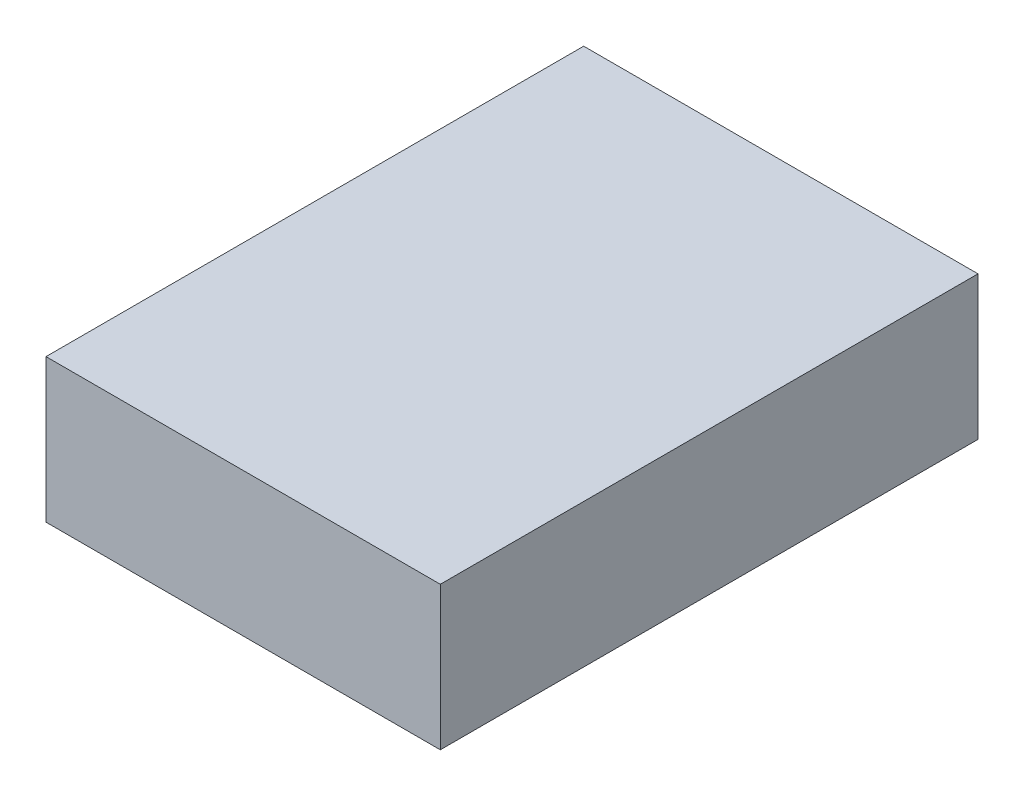
ISO-10303-21;
HEADER;
FILE_DESCRIPTION(('STEP AP214'),'2;1');
FILE_NAME('part.step','',(''),(''),'','','');
FILE_SCHEMA(('AUTOMOTIVE_DESIGN { 1 0 10303 214 1 1 1 1 }'));
ENDSEC;
DATA;
#1=APPLICATION_CONTEXT('core data for automotive mechanical design processes');
#2=APPLICATION_PROTOCOL_DEFINITION('international standard','automotive_design',2000,#1);
#3=PRODUCT_CONTEXT('',#1,'mechanical');
#4=PRODUCT('Part','Part','',(#3));
#5=PRODUCT_RELATED_PRODUCT_CATEGORY('part','',(#4));
#6=PRODUCT_DEFINITION_FORMATION('','',#4);
#7=PRODUCT_DEFINITION_CONTEXT('part definition',#1,'design');
#8=PRODUCT_DEFINITION('design','',#6,#7);
#9=PRODUCT_DEFINITION_SHAPE('','',#8);
#10=(LENGTH_UNIT() NAMED_UNIT(*) SI_UNIT(.MILLI.,.METRE.));
#11=(NAMED_UNIT(*) PLANE_ANGLE_UNIT() SI_UNIT($,.RADIAN.));
#12=(NAMED_UNIT(*) SI_UNIT($,.STERADIAN.) SOLID_ANGLE_UNIT());
#13=UNCERTAINTY_MEASURE_WITH_UNIT(LENGTH_MEASURE(1.E-05),#10,'distance_accuracy_value','');
#14=(GEOMETRIC_REPRESENTATION_CONTEXT(3) GLOBAL_UNCERTAINTY_ASSIGNED_CONTEXT((#13)) GLOBAL_UNIT_ASSIGNED_CONTEXT((#10,
#11,#12)) REPRESENTATION_CONTEXT('',''));
#15=CARTESIAN_POINT('',(0.,0.,0.));
#16=DIRECTION('',(0.,0.,1.));
#17=DIRECTION('',(1.,0.,0.));
#18=AXIS2_PLACEMENT_3D('',#15,#16,#17);
#19=CARTESIAN_POINT('',(0.,25.4,0.));
#20=DIRECTION('',(1.,0.,0.));
#21=DIRECTION('',(0.,0.,-1.));
#22=AXIS2_PLACEMENT_3D('',#19,#20,#21);
#23=PLANE('',#22);
#24=DIRECTION('',(0.,0.,1.));
#25=VECTOR('',#24,1.);
#26=CARTESIAN_POINT('',(0.,0.,0.));
#27=LINE('',#26,#25);
#28=CARTESIAN_POINT('',(0.,0.,-95.25));
#29=VERTEX_POINT('',#28);
#30=CARTESIAN_POINT('',(0.,0.,0.));
#31=VERTEX_POINT('',#30);
#32=EDGE_CURVE('E97',#29,#31,#27,.T.);
#33=ORIENTED_EDGE('',*,*,#32,.T.);
#34=DIRECTION('',(0.,-1.,0.));
#35=VECTOR('',#34,1.);
#36=CARTESIAN_POINT('',(0.,25.4,0.));
#37=LINE('',#36,#35);
#38=CARTESIAN_POINT('',(0.,25.4,0.));
#39=VERTEX_POINT('',#38);
#40=EDGE_CURVE('E11',#39,#31,#37,.T.);
#41=ORIENTED_EDGE('',*,*,#40,.F.);
#42=DIRECTION('',(0.,0.,1.));
#43=VECTOR('',#42,1.);
#44=CARTESIAN_POINT('',(0.,25.4,0.));
#45=LINE('',#44,#43);
#46=CARTESIAN_POINT('',(0.,25.4,-95.25));
#47=VERTEX_POINT('',#46);
#48=EDGE_CURVE('E85',#47,#39,#45,.T.);
#49=ORIENTED_EDGE('',*,*,#48,.F.);
#50=DIRECTION('',(0.,-1.,0.));
#51=VECTOR('',#50,1.);
#52=CARTESIAN_POINT('',(0.,25.4,-95.25));
#53=LINE('',#52,#51);
#54=EDGE_CURVE('E93',#47,#29,#53,.T.);
#55=ORIENTED_EDGE('',*,*,#54,.T.);
#56=EDGE_LOOP('',(#33,#41,#49,#55));
#57=FACE_BOUND('',#56,.T.);
#58=ADVANCED_FACE('F34',(#57),#23,.F.);
#59=CARTESIAN_POINT('',(0.,25.4,0.));
#60=DIRECTION('',(0.,0.,-1.));
#61=DIRECTION('',(-1.,0.,0.));
#62=AXIS2_PLACEMENT_3D('',#59,#60,#61);
#63=PLANE('',#62);
#64=DIRECTION('',(1.,0.,0.));
#65=VECTOR('',#64,1.);
#66=CARTESIAN_POINT('',(0.,0.,0.));
#67=LINE('',#66,#65);
#68=CARTESIAN_POINT('',(69.85,0.,0.));
#69=VERTEX_POINT('',#68);
#70=EDGE_CURVE('E89',#31,#69,#67,.T.);
#71=ORIENTED_EDGE('',*,*,#70,.T.);
#72=DIRECTION('',(0.,-1.,0.));
#73=VECTOR('',#72,1.);
#74=CARTESIAN_POINT('',(69.85,25.4,0.));
#75=LINE('',#74,#73);
#76=CARTESIAN_POINT('',(69.85,25.4,0.));
#77=VERTEX_POINT('',#76);
#78=EDGE_CURVE('E42',#77,#69,#75,.T.);
#79=ORIENTED_EDGE('',*,*,#78,.F.);
#80=DIRECTION('',(1.,0.,0.));
#81=VECTOR('',#80,1.);
#82=CARTESIAN_POINT('',(0.,25.4,0.));
#83=LINE('',#82,#81);
#84=EDGE_CURVE('E80',#39,#77,#83,.T.);
#85=ORIENTED_EDGE('',*,*,#84,.F.);
#86=ORIENTED_EDGE('',*,*,#40,.T.);
#87=EDGE_LOOP('',(#71,#79,#85,#86));
#88=FACE_BOUND('',#87,.T.);
#89=ADVANCED_FACE('F88',(#88),#63,.F.);
#90=CARTESIAN_POINT('',(69.85,25.4,0.));
#91=DIRECTION('',(-1.,0.,0.));
#92=DIRECTION('',(0.,0.,1.));
#93=AXIS2_PLACEMENT_3D('',#90,#91,#92);
#94=PLANE('',#93);
#95=DIRECTION('',(0.,0.,-1.));
#96=VECTOR('',#95,1.);
#97=CARTESIAN_POINT('',(69.85,0.,0.));
#98=LINE('',#97,#96);
#99=CARTESIAN_POINT('',(69.85,0.,-95.25));
#100=VERTEX_POINT('',#99);
#101=EDGE_CURVE('E67',#69,#100,#98,.T.);
#102=ORIENTED_EDGE('',*,*,#101,.T.);
#103=DIRECTION('',(0.,-1.,0.));
#104=VECTOR('',#103,1.);
#105=CARTESIAN_POINT('',(69.85,25.4,-95.25));
#106=LINE('',#105,#104);
#107=CARTESIAN_POINT('',(69.85,25.4,-95.25));
#108=VERTEX_POINT('',#107);
#109=EDGE_CURVE('E90',#108,#100,#106,.T.);
#110=ORIENTED_EDGE('',*,*,#109,.F.);
#111=DIRECTION('',(0.,0.,-1.));
#112=VECTOR('',#111,1.);
#113=CARTESIAN_POINT('',(69.85,25.4,0.));
#114=LINE('',#113,#112);
#115=EDGE_CURVE('E83',#77,#108,#114,.T.);
#116=ORIENTED_EDGE('',*,*,#115,.F.);
#117=ORIENTED_EDGE('',*,*,#78,.T.);
#118=EDGE_LOOP('',(#102,#110,#116,#117));
#119=FACE_BOUND('',#118,.T.);
#120=ADVANCED_FACE('F91',(#119),#94,.F.);
#121=CARTESIAN_POINT('',(0.,25.4,-95.25));
#122=DIRECTION('',(0.,0.,1.));
#123=DIRECTION('',(1.,0.,0.));
#124=AXIS2_PLACEMENT_3D('',#121,#122,#123);
#125=PLANE('',#124);
#126=DIRECTION('',(-1.,0.,0.));
#127=VECTOR('',#126,1.);
#128=CARTESIAN_POINT('',(0.,0.,-95.25));
#129=LINE('',#128,#127);
#130=EDGE_CURVE('E73',#100,#29,#129,.T.);
#131=ORIENTED_EDGE('',*,*,#130,.T.);
#132=ORIENTED_EDGE('',*,*,#54,.F.);
#133=DIRECTION('',(-1.,0.,0.));
#134=VECTOR('',#133,1.);
#135=CARTESIAN_POINT('',(0.,25.4,-95.25));
#136=LINE('',#135,#134);
#137=EDGE_CURVE('E50',#108,#47,#136,.T.);
#138=ORIENTED_EDGE('',*,*,#137,.F.);
#139=ORIENTED_EDGE('',*,*,#109,.T.);
#140=EDGE_LOOP('',(#131,#132,#138,#139));
#141=FACE_BOUND('',#140,.T.);
#142=ADVANCED_FACE('F104',(#141),#125,.F.);
#143=CARTESIAN_POINT('',(0.,25.4,0.));
#144=DIRECTION('',(0.,-1.,0.));
#145=DIRECTION('',(0.,0.,-1.));
#146=AXIS2_PLACEMENT_3D('',#143,#144,#145);
#147=PLANE('',#146);
#148=ORIENTED_EDGE('',*,*,#48,.T.);
#149=ORIENTED_EDGE('',*,*,#84,.T.);
#150=ORIENTED_EDGE('',*,*,#115,.T.);
#151=ORIENTED_EDGE('',*,*,#137,.T.);
#152=EDGE_LOOP('',(#148,#149,#150,#151));
#153=FACE_BOUND('',#152,.T.);
#154=ADVANCED_FACE('F81',(#153),#147,.F.);
#155=CARTESIAN_POINT('',(0.,0.,0.));
#156=DIRECTION('',(0.,-1.,0.));
#157=DIRECTION('',(0.,0.,-1.));
#158=AXIS2_PLACEMENT_3D('',#155,#156,#157);
#159=PLANE('',#158);
#160=ORIENTED_EDGE('',*,*,#32,.F.);
#161=ORIENTED_EDGE('',*,*,#130,.F.);
#162=ORIENTED_EDGE('',*,*,#101,.F.);
#163=ORIENTED_EDGE('',*,*,#70,.F.);
#164=EDGE_LOOP('',(#160,#161,#162,#163));
#165=FACE_BOUND('',#164,.T.);
#166=ADVANCED_FACE('F107',(#165),#159,.T.);
#167=CLOSED_SHELL('',(#58,#89,#120,#142,#154,#166));
#168=MANIFOLD_SOLID_BREP('B2',#167);
#169=ADVANCED_BREP_SHAPE_REPRESENTATION('',(#18,#168),#14);
#170=SHAPE_DEFINITION_REPRESENTATION(#9,#169);
ENDSEC;
END-ISO-10303-21;
